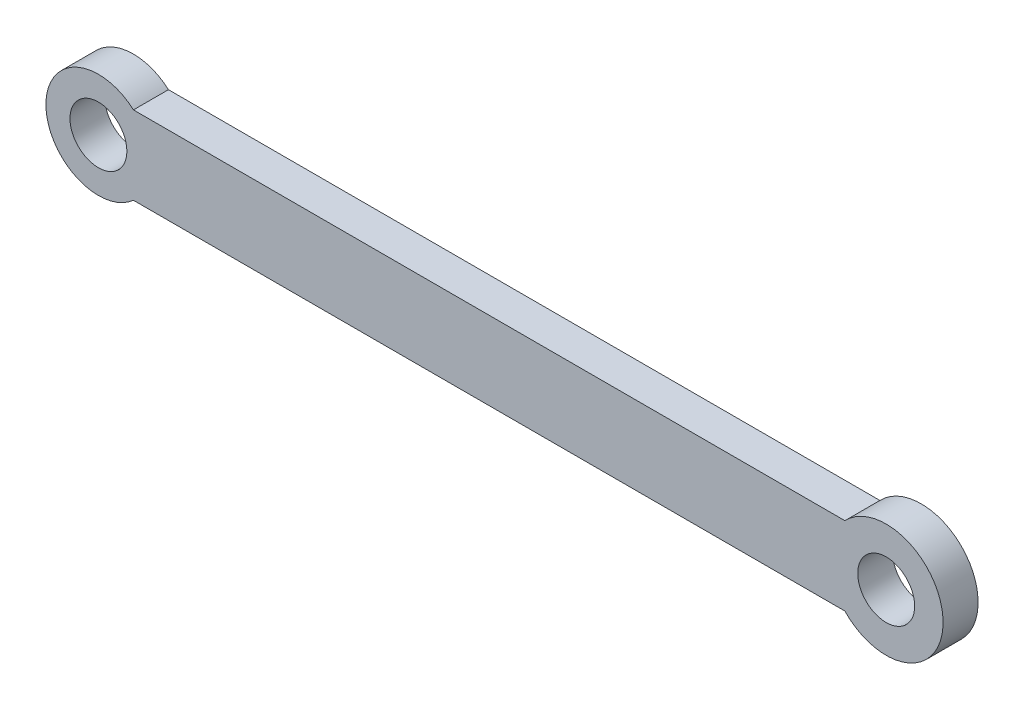
ISO-10303-21;
HEADER;
FILE_DESCRIPTION(('STEP AP214'),'2;1');
FILE_NAME('part.step','',(''),(''),'','','');
FILE_SCHEMA(('AUTOMOTIVE_DESIGN { 1 0 10303 214 1 1 1 1 }'));
ENDSEC;
DATA;
#1=APPLICATION_CONTEXT('core data for automotive mechanical design processes');
#2=APPLICATION_PROTOCOL_DEFINITION('international standard','automotive_design',2000,#1);
#3=PRODUCT_CONTEXT('',#1,'mechanical');
#4=PRODUCT('Part','Part','',(#3));
#5=PRODUCT_RELATED_PRODUCT_CATEGORY('part','',(#4));
#6=PRODUCT_DEFINITION_FORMATION('','',#4);
#7=PRODUCT_DEFINITION_CONTEXT('part definition',#1,'design');
#8=PRODUCT_DEFINITION('design','',#6,#7);
#9=PRODUCT_DEFINITION_SHAPE('','',#8);
#10=(LENGTH_UNIT() NAMED_UNIT(*) SI_UNIT(.MILLI.,.METRE.));
#11=(NAMED_UNIT(*) PLANE_ANGLE_UNIT() SI_UNIT($,.RADIAN.));
#12=(NAMED_UNIT(*) SI_UNIT($,.STERADIAN.) SOLID_ANGLE_UNIT());
#13=UNCERTAINTY_MEASURE_WITH_UNIT(LENGTH_MEASURE(1.E-05),#10,'distance_accuracy_value','');
#14=(GEOMETRIC_REPRESENTATION_CONTEXT(3) GLOBAL_UNCERTAINTY_ASSIGNED_CONTEXT((#13)) GLOBAL_UNIT_ASSIGNED_CONTEXT((#10,
#11,#12)) REPRESENTATION_CONTEXT('',''));
#15=CARTESIAN_POINT('',(0.,0.,0.));
#16=DIRECTION('',(0.,0.,1.));
#17=DIRECTION('',(1.,0.,0.));
#18=AXIS2_PLACEMENT_3D('',#15,#16,#17);
#19=CARTESIAN_POINT('',(0.,0.,4.));
#20=DIRECTION('',(0.,0.,-1.));
#21=DIRECTION('',(-1.,0.,0.));
#22=AXIS2_PLACEMENT_3D('',#19,#20,#21);
#23=CYLINDRICAL_SURFACE('',#22,6.);
#24=CARTESIAN_POINT('',(0.,0.,0.));
#25=DIRECTION('',(0.,0.,1.));
#26=DIRECTION('',(1.,0.,0.));
#27=AXIS2_PLACEMENT_3D('',#24,#25,#26);
#28=CIRCLE('',#27,6.);
#29=CARTESIAN_POINT('',(4.,4.47213595499958,0.));
#30=VERTEX_POINT('',#29);
#31=CARTESIAN_POINT('',(4.,-4.47213595499958,0.));
#32=VERTEX_POINT('',#31);
#33=EDGE_CURVE('E108',#30,#32,#28,.T.);
#34=ORIENTED_EDGE('',*,*,#33,.T.);
#35=DIRECTION('',(0.,0.,-1.));
#36=VECTOR('',#35,1.);
#37=CARTESIAN_POINT('',(4.,-4.47213595499958,4.));
#38=LINE('',#37,#36);
#39=CARTESIAN_POINT('',(4.,-4.47213595499958,4.));
#40=VERTEX_POINT('',#39);
#41=EDGE_CURVE('E11',#40,#32,#38,.T.);
#42=ORIENTED_EDGE('',*,*,#41,.F.);
#43=CARTESIAN_POINT('',(0.,0.,4.));
#44=DIRECTION('',(0.,0.,1.));
#45=DIRECTION('',(1.,0.,0.));
#46=AXIS2_PLACEMENT_3D('',#43,#44,#45);
#47=CIRCLE('',#46,6.);
#48=CARTESIAN_POINT('',(4.,4.47213595499958,4.));
#49=VERTEX_POINT('',#48);
#50=EDGE_CURVE('E124',#49,#40,#47,.T.);
#51=ORIENTED_EDGE('',*,*,#50,.F.);
#52=DIRECTION('',(0.,0.,-1.));
#53=VECTOR('',#52,1.);
#54=CARTESIAN_POINT('',(4.,4.47213595499958,4.));
#55=LINE('',#54,#53);
#56=EDGE_CURVE('E53',#49,#30,#55,.T.);
#57=ORIENTED_EDGE('',*,*,#56,.T.);
#58=EDGE_LOOP('',(#34,#42,#51,#57));
#59=FACE_BOUND('',#58,.T.);
#60=ADVANCED_FACE('F43',(#59),#23,.T.);
#61=CARTESIAN_POINT('',(0.,-4.47213595499958,4.));
#62=DIRECTION('',(0.,1.,0.));
#63=DIRECTION('',(0.,0.,1.));
#64=AXIS2_PLACEMENT_3D('',#61,#62,#63);
#65=PLANE('',#64);
#66=DIRECTION('',(1.,0.,0.));
#67=VECTOR('',#66,1.);
#68=CARTESIAN_POINT('',(0.,-4.47213595499958,0.));
#69=LINE('',#68,#67);
#70=CARTESIAN_POINT('',(85.2830094339717,-4.47213595499957,0.));
#71=VERTEX_POINT('',#70);
#72=EDGE_CURVE('E72',#32,#71,#69,.T.);
#73=ORIENTED_EDGE('',*,*,#72,.T.);
#74=DIRECTION('',(0.,0.,1.));
#75=VECTOR('',#74,1.);
#76=CARTESIAN_POINT('',(85.2830094339717,-4.47213595499958,-18.3847763108502));
#77=LINE('',#76,#75);
#78=CARTESIAN_POINT('',(85.2830094339717,-4.47213595499957,4.));
#79=VERTEX_POINT('',#78);
#80=EDGE_CURVE('E87',#71,#79,#77,.T.);
#81=ORIENTED_EDGE('',*,*,#80,.T.);
#82=DIRECTION('',(1.,0.,0.));
#83=VECTOR('',#82,1.);
#84=CARTESIAN_POINT('',(0.,-4.47213595499958,4.));
#85=LINE('',#84,#83);
#86=EDGE_CURVE('E120',#40,#79,#85,.T.);
#87=ORIENTED_EDGE('',*,*,#86,.F.);
#88=ORIENTED_EDGE('',*,*,#41,.T.);
#89=EDGE_LOOP('',(#73,#81,#87,#88));
#90=FACE_BOUND('',#89,.T.);
#91=ADVANCED_FACE('F104',(#90),#65,.F.);
#92=CARTESIAN_POINT('',(0.,0.,4.));
#93=DIRECTION('',(0.,0.,-1.));
#94=DIRECTION('',(-1.,0.,0.));
#95=AXIS2_PLACEMENT_3D('',#92,#93,#94);
#96=CYLINDRICAL_SURFACE('',#95,3.25);
#97=CARTESIAN_POINT('',(0.,0.,4.));
#98=DIRECTION('',(0.,0.,1.));
#99=DIRECTION('',(1.,0.,0.));
#100=AXIS2_PLACEMENT_3D('',#97,#98,#99);
#101=CIRCLE('',#100,3.25);
#102=CARTESIAN_POINT('',(3.25,0.,4.));
#103=VERTEX_POINT('',#102);
#104=EDGE_CURVE('E112',#103,#103,#101,.T.);
#105=ORIENTED_EDGE('',*,*,#104,.T.);
#106=EDGE_LOOP('',(#105));
#107=FACE_BOUND('',#106,.T.);
#108=CARTESIAN_POINT('',(0.,0.,0.));
#109=DIRECTION('',(0.,0.,1.));
#110=DIRECTION('',(1.,0.,0.));
#111=AXIS2_PLACEMENT_3D('',#108,#109,#110);
#112=CIRCLE('',#111,3.25);
#113=CARTESIAN_POINT('',(3.25,0.,0.));
#114=VERTEX_POINT('',#113);
#115=EDGE_CURVE('E94',#114,#114,#112,.T.);
#116=ORIENTED_EDGE('',*,*,#115,.F.);
#117=EDGE_LOOP('',(#116));
#118=FACE_BOUND('',#117,.T.);
#119=ADVANCED_FACE('F45',(#107,#118),#96,.F.);
#120=CARTESIAN_POINT('',(0.,4.47213595499958,4.));
#121=DIRECTION('',(0.,1.,0.));
#122=DIRECTION('',(-1.,0.,0.));
#123=AXIS2_PLACEMENT_3D('',#120,#121,#122);
#124=PLANE('',#123);
#125=DIRECTION('',(0.,0.,1.));
#126=VECTOR('',#125,1.);
#127=CARTESIAN_POINT('',(85.2830094339717,4.47213595499958,-18.3847763108502));
#128=LINE('',#127,#126);
#129=CARTESIAN_POINT('',(85.2830094339717,4.47213595499957,0.));
#130=VERTEX_POINT('',#129);
#131=CARTESIAN_POINT('',(85.2830094339717,4.47213595499957,4.));
#132=VERTEX_POINT('',#131);
#133=EDGE_CURVE('E95',#130,#132,#128,.T.);
#134=ORIENTED_EDGE('',*,*,#133,.F.);
#135=DIRECTION('',(1.,0.,0.));
#136=VECTOR('',#135,1.);
#137=CARTESIAN_POINT('',(0.,4.47213595499958,0.));
#138=LINE('',#137,#136);
#139=EDGE_CURVE('E100',#30,#130,#138,.T.);
#140=ORIENTED_EDGE('',*,*,#139,.F.);
#141=ORIENTED_EDGE('',*,*,#56,.F.);
#142=DIRECTION('',(1.,0.,0.));
#143=VECTOR('',#142,1.);
#144=CARTESIAN_POINT('',(0.,4.47213595499958,4.));
#145=LINE('',#144,#143);
#146=EDGE_CURVE('E117',#49,#132,#145,.T.);
#147=ORIENTED_EDGE('',*,*,#146,.T.);
#148=EDGE_LOOP('',(#134,#140,#141,#147));
#149=FACE_BOUND('',#148,.T.);
#150=ADVANCED_FACE('F132',(#149),#124,.T.);
#151=CARTESIAN_POINT('',(0.,0.,4.));
#152=DIRECTION('',(0.,0.,1.));
#153=DIRECTION('',(1.,0.,0.));
#154=AXIS2_PLACEMENT_3D('',#151,#152,#153);
#155=PLANE('',#154);
#156=CARTESIAN_POINT('',(90.,0.,4.));
#157=DIRECTION('',(0.,0.,1.));
#158=DIRECTION('',(1.,0.,0.));
#159=AXIS2_PLACEMENT_3D('',#156,#157,#158);
#160=CIRCLE('',#159,3.25000000000001);
#161=CARTESIAN_POINT('',(93.25,0.,4.));
#162=VERTEX_POINT('',#161);
#163=EDGE_CURVE('E164',#162,#162,#160,.T.);
#164=ORIENTED_EDGE('',*,*,#163,.F.);
#165=EDGE_LOOP('',(#164));
#166=FACE_BOUND('',#165,.T.);
#167=ORIENTED_EDGE('',*,*,#86,.T.);
#168=CARTESIAN_POINT('',(90.,0.,4.));
#169=DIRECTION('',(0.,0.,1.));
#170=DIRECTION('',(1.,0.,0.));
#171=AXIS2_PLACEMENT_3D('',#168,#169,#170);
#172=CIRCLE('',#171,6.5);
#173=EDGE_CURVE('E79',#79,#132,#172,.T.);
#174=ORIENTED_EDGE('',*,*,#173,.T.);
#175=ORIENTED_EDGE('',*,*,#146,.F.);
#176=ORIENTED_EDGE('',*,*,#50,.T.);
#177=EDGE_LOOP('',(#167,#174,#175,#176));
#178=FACE_BOUND('',#177,.T.);
#179=ORIENTED_EDGE('',*,*,#104,.F.);
#180=EDGE_LOOP('',(#179));
#181=FACE_BOUND('',#180,.T.);
#182=ADVANCED_FACE('F139',(#166,#178,#181),#155,.T.);
#183=CARTESIAN_POINT('',(0.,0.,0.));
#184=DIRECTION('',(0.,0.,1.));
#185=DIRECTION('',(1.,0.,0.));
#186=AXIS2_PLACEMENT_3D('',#183,#184,#185);
#187=PLANE('',#186);
#188=CARTESIAN_POINT('',(90.,0.,0.));
#189=DIRECTION('',(0.,0.,1.));
#190=DIRECTION('',(1.,0.,0.));
#191=AXIS2_PLACEMENT_3D('',#188,#189,#190);
#192=CIRCLE('',#191,3.25000000000001);
#193=CARTESIAN_POINT('',(93.25,0.,0.));
#194=VERTEX_POINT('',#193);
#195=EDGE_CURVE('E102',#194,#194,#192,.F.);
#196=ORIENTED_EDGE('',*,*,#195,.F.);
#197=EDGE_LOOP('',(#196));
#198=FACE_BOUND('',#197,.T.);
#199=CARTESIAN_POINT('',(90.,0.,0.));
#200=DIRECTION('',(0.,0.,1.));
#201=DIRECTION('',(1.,0.,0.));
#202=AXIS2_PLACEMENT_3D('',#199,#200,#201);
#203=CIRCLE('',#202,6.5);
#204=EDGE_CURVE('E89',#130,#71,#203,.F.);
#205=ORIENTED_EDGE('',*,*,#204,.T.);
#206=ORIENTED_EDGE('',*,*,#72,.F.);
#207=ORIENTED_EDGE('',*,*,#33,.F.);
#208=ORIENTED_EDGE('',*,*,#139,.T.);
#209=EDGE_LOOP('',(#205,#206,#207,#208));
#210=FACE_BOUND('',#209,.T.);
#211=ORIENTED_EDGE('',*,*,#115,.T.);
#212=EDGE_LOOP('',(#211));
#213=FACE_BOUND('',#212,.T.);
#214=ADVANCED_FACE('F98',(#198,#210,#213),#187,.F.);
#215=CARTESIAN_POINT('',(90.,0.,-18.3847763108502));
#216=DIRECTION('',(0.,0.,1.));
#217=DIRECTION('',(1.,0.,0.));
#218=AXIS2_PLACEMENT_3D('',#215,#216,#217);
#219=CYLINDRICAL_SURFACE('',#218,6.5);
#220=ORIENTED_EDGE('',*,*,#80,.F.);
#221=ORIENTED_EDGE('',*,*,#204,.F.);
#222=ORIENTED_EDGE('',*,*,#133,.T.);
#223=ORIENTED_EDGE('',*,*,#173,.F.);
#224=EDGE_LOOP('',(#220,#221,#222,#223));
#225=FACE_BOUND('',#224,.T.);
#226=ADVANCED_FACE('F88',(#225),#219,.T.);
#227=CARTESIAN_POINT('',(90.,0.,-18.3847763108502));
#228=DIRECTION('',(0.,0.,1.));
#229=DIRECTION('',(1.,0.,0.));
#230=AXIS2_PLACEMENT_3D('',#227,#228,#229);
#231=CYLINDRICAL_SURFACE('',#230,3.25000000000001);
#232=ORIENTED_EDGE('',*,*,#163,.T.);
#233=EDGE_LOOP('',(#232));
#234=FACE_BOUND('',#233,.T.);
#235=ORIENTED_EDGE('',*,*,#195,.T.);
#236=EDGE_LOOP('',(#235));
#237=FACE_BOUND('',#236,.T.);
#238=ADVANCED_FACE('F156',(#234,#237),#231,.F.);
#239=CLOSED_SHELL('',(#60,#91,#119,#150,#182,#214,#226,#238));
#240=MANIFOLD_SOLID_BREP('B2',#239);
#241=ADVANCED_BREP_SHAPE_REPRESENTATION('',(#18,#240),#14);
#242=SHAPE_DEFINITION_REPRESENTATION(#9,#241);
ENDSEC;
END-ISO-10303-21;
